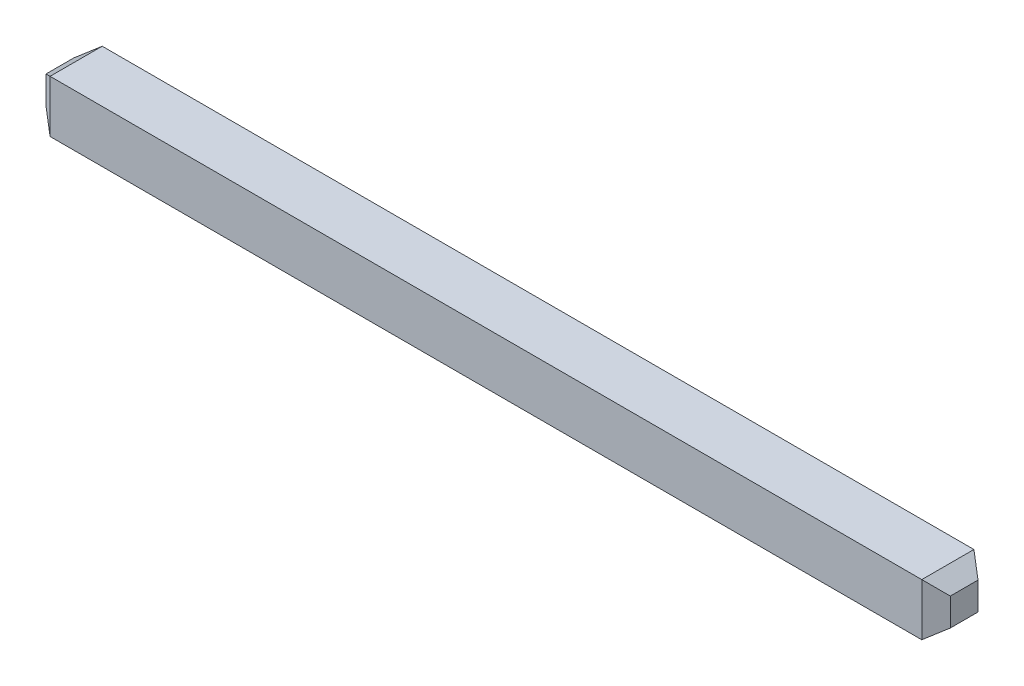
ISO-10303-21;
HEADER;
FILE_DESCRIPTION(('STEP AP214'),'2;1');
FILE_NAME('part.step','',(''),(''),'','','');
FILE_SCHEMA(('AUTOMOTIVE_DESIGN { 1 0 10303 214 1 1 1 1 }'));
ENDSEC;
DATA;
#1=APPLICATION_CONTEXT('core data for automotive mechanical design processes');
#2=APPLICATION_PROTOCOL_DEFINITION('international standard','automotive_design',2000,#1);
#3=PRODUCT_CONTEXT('',#1,'mechanical');
#4=PRODUCT('Part','Part','',(#3));
#5=PRODUCT_RELATED_PRODUCT_CATEGORY('part','',(#4));
#6=PRODUCT_DEFINITION_FORMATION('','',#4);
#7=PRODUCT_DEFINITION_CONTEXT('part definition',#1,'design');
#8=PRODUCT_DEFINITION('design','',#6,#7);
#9=PRODUCT_DEFINITION_SHAPE('','',#8);
#10=(LENGTH_UNIT() NAMED_UNIT(*) SI_UNIT(.MILLI.,.METRE.));
#11=(NAMED_UNIT(*) PLANE_ANGLE_UNIT() SI_UNIT($,.RADIAN.));
#12=(NAMED_UNIT(*) SI_UNIT($,.STERADIAN.) SOLID_ANGLE_UNIT());
#13=UNCERTAINTY_MEASURE_WITH_UNIT(LENGTH_MEASURE(1.E-05),#10,'distance_accuracy_value','');
#14=(GEOMETRIC_REPRESENTATION_CONTEXT(3) GLOBAL_UNCERTAINTY_ASSIGNED_CONTEXT((#13)) GLOBAL_UNIT_ASSIGNED_CONTEXT((#10,
#11,#12)) REPRESENTATION_CONTEXT('',''));
#15=CARTESIAN_POINT('',(0.,0.,0.));
#16=DIRECTION('',(0.,0.,1.));
#17=DIRECTION('',(1.,0.,0.));
#18=AXIS2_PLACEMENT_3D('',#15,#16,#17);
#19=CARTESIAN_POINT('',(-2.4,1.23,-6.595));
#20=DIRECTION('',(0.6,0.,0.8));
#21=DIRECTION('',(0.8,0.,-0.6));
#22=AXIS2_PLACEMENT_3D('',#19,#20,#21);
#23=PLANE('',#22);
#24=DIRECTION('',(0.,1.,0.));
#25=VECTOR('',#24,1.);
#26=CARTESIAN_POINT('',(-2.3,1.23,-6.67));
#27=LINE('',#26,#25);
#28=CARTESIAN_POINT('',(-2.3,1.55,-6.67));
#29=VERTEX_POINT('',#28);
#30=CARTESIAN_POINT('',(-2.30000000000001,0.909999999999898,-6.67));
#31=VERTEX_POINT('',#30);
#32=EDGE_CURVE('E101',#29,#31,#27,.F.);
#33=ORIENTED_EDGE('',*,*,#32,.T.);
#34=DIRECTION('',(-0.685994340569492,0.514495755428341,0.514495755427436));
#35=VECTOR('',#34,1.);
#36=CARTESIAN_POINT('',(-2.30000000000009,0.909999999999786,-6.67));
#37=LINE('',#36,#35);
#38=CARTESIAN_POINT('',(-2.49999999999999,1.06000000000001,-6.52));
#39=VERTEX_POINT('',#38);
#40=EDGE_CURVE('E85',#31,#39,#37,.T.);
#41=ORIENTED_EDGE('',*,*,#40,.T.);
#42=DIRECTION('',(0.,1.,0.));
#43=VECTOR('',#42,1.);
#44=CARTESIAN_POINT('',(-2.5,1.23,-6.52));
#45=LINE('',#44,#43);
#46=CARTESIAN_POINT('',(-2.5,1.4,-6.52));
#47=VERTEX_POINT('',#46);
#48=EDGE_CURVE('E79',#39,#47,#45,.T.);
#49=ORIENTED_EDGE('',*,*,#48,.T.);
#50=DIRECTION('',(-0.685994340570035,-0.514495755427527,0.514495755427526));
#51=VECTOR('',#50,1.);
#52=CARTESIAN_POINT('',(-2.3,1.55,-6.67));
#53=LINE('',#52,#51);
#54=EDGE_CURVE('E20',#29,#47,#53,.T.);
#55=ORIENTED_EDGE('',*,*,#54,.F.);
#56=EDGE_LOOP('',(#33,#41,#49,#55));
#57=FACE_BOUND('',#56,.T.);
#58=ADVANCED_FACE('F17',(#57),#23,.F.);
#59=CARTESIAN_POINT('',(8.5,1.23,-6.595));
#60=DIRECTION('',(-0.6,0.,0.8));
#61=DIRECTION('',(0.8,0.,0.6));
#62=AXIS2_PLACEMENT_3D('',#59,#60,#61);
#63=PLANE('',#62);
#64=DIRECTION('',(0.,1.,0.));
#65=VECTOR('',#64,1.);
#66=CARTESIAN_POINT('',(8.6,1.23,-6.52));
#67=LINE('',#66,#65);
#68=CARTESIAN_POINT('',(8.59999999999998,1.06000000000003,-6.52));
#69=VERTEX_POINT('',#68);
#70=CARTESIAN_POINT('',(8.6,1.4,-6.52));
#71=VERTEX_POINT('',#70);
#72=EDGE_CURVE('E113',#69,#71,#67,.T.);
#73=ORIENTED_EDGE('',*,*,#72,.F.);
#74=DIRECTION('',(-0.685994340569493,-0.514495755428341,-0.514495755427435));
#75=VECTOR('',#74,1.);
#76=CARTESIAN_POINT('',(8.59999999999996,1.06000000000005,-6.52));
#77=LINE('',#76,#75);
#78=CARTESIAN_POINT('',(8.40000000000002,0.909999999999884,-6.67));
#79=VERTEX_POINT('',#78);
#80=EDGE_CURVE('E108',#69,#79,#77,.T.);
#81=ORIENTED_EDGE('',*,*,#80,.T.);
#82=DIRECTION('',(0.,1.,0.));
#83=VECTOR('',#82,1.);
#84=CARTESIAN_POINT('',(8.4,1.23,-6.67));
#85=LINE('',#84,#83);
#86=CARTESIAN_POINT('',(8.4,1.55,-6.67));
#87=VERTEX_POINT('',#86);
#88=EDGE_CURVE('E99',#79,#87,#85,.T.);
#89=ORIENTED_EDGE('',*,*,#88,.T.);
#90=DIRECTION('',(-0.685994340570034,0.514495755427526,-0.514495755427529));
#91=VECTOR('',#90,1.);
#92=CARTESIAN_POINT('',(8.6,1.4,-6.52));
#93=LINE('',#92,#91);
#94=EDGE_CURVE('E116',#71,#87,#93,.T.);
#95=ORIENTED_EDGE('',*,*,#94,.F.);
#96=EDGE_LOOP('',(#73,#81,#89,#95));
#97=FACE_BOUND('',#96,.T.);
#98=ADVANCED_FACE('F214',(#97),#63,.F.);
#99=CARTESIAN_POINT('',(-2.4,1.475,-6.35));
#100=DIRECTION('',(-0.6,0.8,0.));
#101=DIRECTION('',(-0.8,-0.6,0.));
#102=AXIS2_PLACEMENT_3D('',#99,#100,#101);
#103=PLANE('',#102);
#104=DIRECTION('',(-0.685994340570036,-0.514495755427528,-0.514495755427524));
#105=VECTOR('',#104,1.);
#106=CARTESIAN_POINT('',(-2.3,1.55,-6.03));
#107=LINE('',#106,#105);
#108=CARTESIAN_POINT('',(-2.3,1.55,-6.03));
#109=VERTEX_POINT('',#108);
#110=CARTESIAN_POINT('',(-2.5,1.4,-6.18));
#111=VERTEX_POINT('',#110);
#112=EDGE_CURVE('E128',#109,#111,#107,.T.);
#113=ORIENTED_EDGE('',*,*,#112,.F.);
#114=DIRECTION('',(0.,0.,1.));
#115=VECTOR('',#114,1.);
#116=CARTESIAN_POINT('',(-2.3,1.55,-6.35));
#117=LINE('',#116,#115);
#118=EDGE_CURVE('E93',#29,#109,#117,.T.);
#119=ORIENTED_EDGE('',*,*,#118,.F.);
#120=ORIENTED_EDGE('',*,*,#54,.T.);
#121=DIRECTION('',(0.,0.,-1.));
#122=VECTOR('',#121,1.);
#123=CARTESIAN_POINT('',(-2.5,1.4,-6.35));
#124=LINE('',#123,#122);
#125=EDGE_CURVE('E87',#47,#111,#124,.F.);
#126=ORIENTED_EDGE('',*,*,#125,.T.);
#127=EDGE_LOOP('',(#113,#119,#120,#126));
#128=FACE_BOUND('',#127,.T.);
#129=ADVANCED_FACE('F90',(#128),#103,.T.);
#130=CARTESIAN_POINT('',(-2.5,1.23,-6.35));
#131=DIRECTION('',(1.,0.,0.));
#132=DIRECTION('',(0.,0.,-1.));
#133=AXIS2_PLACEMENT_3D('',#130,#131,#132);
#134=PLANE('',#133);
#135=DIRECTION('',(0.,1.,0.));
#136=VECTOR('',#135,1.);
#137=CARTESIAN_POINT('',(-2.5,1.23,-6.18));
#138=LINE('',#137,#136);
#139=CARTESIAN_POINT('',(-2.49999999999999,1.06000000000001,-6.18));
#140=VERTEX_POINT('',#139);
#141=EDGE_CURVE('E97',#111,#140,#138,.F.);
#142=ORIENTED_EDGE('',*,*,#141,.F.);
#143=ORIENTED_EDGE('',*,*,#125,.F.);
#144=ORIENTED_EDGE('',*,*,#48,.F.);
#145=DIRECTION('',(0.,0.,1.));
#146=VECTOR('',#145,1.);
#147=CARTESIAN_POINT('',(-2.49999999999996,1.06000000000005,-6.35));
#148=LINE('',#147,#146);
#149=EDGE_CURVE('E105',#39,#140,#148,.T.);
#150=ORIENTED_EDGE('',*,*,#149,.T.);
#151=EDGE_LOOP('',(#142,#143,#144,#150));
#152=FACE_BOUND('',#151,.T.);
#153=ADVANCED_FACE('F95',(#152),#134,.F.);
#154=CARTESIAN_POINT('',(3.05,1.23,-6.67));
#155=DIRECTION('',(0.,0.,1.));
#156=DIRECTION('',(1.,0.,0.));
#157=AXIS2_PLACEMENT_3D('',#154,#155,#156);
#158=PLANE('',#157);
#159=ORIENTED_EDGE('',*,*,#32,.F.);
#160=DIRECTION('',(1.,0.,0.));
#161=VECTOR('',#160,1.);
#162=CARTESIAN_POINT('',(3.05,1.55,-6.67));
#163=LINE('',#162,#161);
#164=EDGE_CURVE('E122',#87,#29,#163,.F.);
#165=ORIENTED_EDGE('',*,*,#164,.F.);
#166=ORIENTED_EDGE('',*,*,#88,.F.);
#167=DIRECTION('',(1.,0.,0.));
#168=VECTOR('',#167,1.);
#169=CARTESIAN_POINT('',(3.05,0.91,-6.67));
#170=LINE('',#169,#168);
#171=EDGE_CURVE('E136',#79,#31,#170,.F.);
#172=ORIENTED_EDGE('',*,*,#171,.T.);
#173=EDGE_LOOP('',(#159,#165,#166,#172));
#174=FACE_BOUND('',#173,.T.);
#175=ADVANCED_FACE('F182',(#174),#158,.F.);
#176=CARTESIAN_POINT('',(-2.4,0.9849999999999,-6.35));
#177=DIRECTION('',(0.600000000000912,0.799999999999316,0.));
#178=DIRECTION('',(-0.799999999999316,0.600000000000912,0.));
#179=AXIS2_PLACEMENT_3D('',#176,#177,#178);
#180=PLANE('',#179);
#181=DIRECTION('',(0.,0.,1.));
#182=VECTOR('',#181,1.);
#183=CARTESIAN_POINT('',(-2.3,0.91,-6.35));
#184=LINE('',#183,#182);
#185=CARTESIAN_POINT('',(-2.30000000000004,0.909999999999856,-6.03));
#186=VERTEX_POINT('',#185);
#187=EDGE_CURVE('E139',#31,#186,#184,.T.);
#188=ORIENTED_EDGE('',*,*,#187,.T.);
#189=DIRECTION('',(0.685994340569915,-0.51449575542778,0.514495755427434));
#190=VECTOR('',#189,1.);
#191=CARTESIAN_POINT('',(-2.5,1.06,-6.18));
#192=LINE('',#191,#190);
#193=EDGE_CURVE('E131',#140,#186,#192,.T.);
#194=ORIENTED_EDGE('',*,*,#193,.F.);
#195=ORIENTED_EDGE('',*,*,#149,.F.);
#196=ORIENTED_EDGE('',*,*,#40,.F.);
#197=EDGE_LOOP('',(#188,#194,#195,#196));
#198=FACE_BOUND('',#197,.T.);
#199=ADVANCED_FACE('F179',(#198),#180,.F.);
#200=CARTESIAN_POINT('',(8.5,0.9849999999999,-6.35));
#201=DIRECTION('',(-0.600000000000912,0.799999999999316,0.));
#202=DIRECTION('',(-0.799999999999316,-0.600000000000912,0.));
#203=AXIS2_PLACEMENT_3D('',#200,#201,#202);
#204=PLANE('',#203);
#205=DIRECTION('',(0.,0.,-1.));
#206=VECTOR('',#205,1.);
#207=CARTESIAN_POINT('',(8.6,1.06,-6.35));
#208=LINE('',#207,#206);
#209=CARTESIAN_POINT('',(8.59999999999998,1.06000000000003,-6.18));
#210=VERTEX_POINT('',#209);
#211=EDGE_CURVE('E110',#210,#69,#208,.T.);
#212=ORIENTED_EDGE('',*,*,#211,.F.);
#213=DIRECTION('',(0.685994340569913,0.514495755427781,-0.514495755427435));
#214=VECTOR('',#213,1.);
#215=CARTESIAN_POINT('',(8.4,0.9099999999999,-6.03));
#216=LINE('',#215,#214);
#217=CARTESIAN_POINT('',(8.40000000000004,0.909999999999868,-6.03));
#218=VERTEX_POINT('',#217);
#219=EDGE_CURVE('E35',#218,#210,#216,.T.);
#220=ORIENTED_EDGE('',*,*,#219,.F.);
#221=DIRECTION('',(0.,0.,1.));
#222=VECTOR('',#221,1.);
#223=CARTESIAN_POINT('',(8.4,0.91,-6.35));
#224=LINE('',#223,#222);
#225=EDGE_CURVE('E134',#218,#79,#224,.F.);
#226=ORIENTED_EDGE('',*,*,#225,.T.);
#227=ORIENTED_EDGE('',*,*,#80,.F.);
#228=EDGE_LOOP('',(#212,#220,#226,#227));
#229=FACE_BOUND('',#228,.T.);
#230=ADVANCED_FACE('F181',(#229),#204,.F.);
#231=CARTESIAN_POINT('',(8.6,1.23,-6.35));
#232=DIRECTION('',(1.,0.,0.));
#233=DIRECTION('',(0.,0.,-1.));
#234=AXIS2_PLACEMENT_3D('',#231,#232,#233);
#235=PLANE('',#234);
#236=ORIENTED_EDGE('',*,*,#72,.T.);
#237=DIRECTION('',(0.,0.,1.));
#238=VECTOR('',#237,1.);
#239=CARTESIAN_POINT('',(8.6,1.4,-6.35));
#240=LINE('',#239,#238);
#241=CARTESIAN_POINT('',(8.6,1.4,-6.18));
#242=VERTEX_POINT('',#241);
#243=EDGE_CURVE('E119',#242,#71,#240,.F.);
#244=ORIENTED_EDGE('',*,*,#243,.F.);
#245=DIRECTION('',(0.,1.,0.));
#246=VECTOR('',#245,1.);
#247=CARTESIAN_POINT('',(8.6,1.23,-6.18));
#248=LINE('',#247,#246);
#249=EDGE_CURVE('E142',#210,#242,#248,.T.);
#250=ORIENTED_EDGE('',*,*,#249,.F.);
#251=ORIENTED_EDGE('',*,*,#211,.T.);
#252=EDGE_LOOP('',(#236,#244,#250,#251));
#253=FACE_BOUND('',#252,.T.);
#254=ADVANCED_FACE('F189',(#253),#235,.T.);
#255=CARTESIAN_POINT('',(8.5,1.475,-6.35));
#256=DIRECTION('',(0.6,0.8,0.));
#257=DIRECTION('',(-0.8,0.6,0.));
#258=AXIS2_PLACEMENT_3D('',#255,#256,#257);
#259=PLANE('',#258);
#260=DIRECTION('',(-0.685994340570034,0.514495755427529,0.514495755427526));
#261=VECTOR('',#260,1.);
#262=CARTESIAN_POINT('',(8.6,1.4,-6.18));
#263=LINE('',#262,#261);
#264=CARTESIAN_POINT('',(8.4,1.55,-6.03));
#265=VERTEX_POINT('',#264);
#266=EDGE_CURVE('E145',#242,#265,#263,.T.);
#267=ORIENTED_EDGE('',*,*,#266,.F.);
#268=ORIENTED_EDGE('',*,*,#243,.T.);
#269=ORIENTED_EDGE('',*,*,#94,.T.);
#270=DIRECTION('',(0.,0.,1.));
#271=VECTOR('',#270,1.);
#272=CARTESIAN_POINT('',(8.4,1.55,-6.35));
#273=LINE('',#272,#271);
#274=EDGE_CURVE('E125',#265,#87,#273,.F.);
#275=ORIENTED_EDGE('',*,*,#274,.F.);
#276=EDGE_LOOP('',(#267,#268,#269,#275));
#277=FACE_BOUND('',#276,.T.);
#278=ADVANCED_FACE('F170',(#277),#259,.T.);
#279=CARTESIAN_POINT('',(3.05,1.55,-6.35));
#280=DIRECTION('',(0.,1.,0.));
#281=DIRECTION('',(0.,0.,1.));
#282=AXIS2_PLACEMENT_3D('',#279,#280,#281);
#283=PLANE('',#282);
#284=DIRECTION('',(1.,0.,0.));
#285=VECTOR('',#284,1.);
#286=CARTESIAN_POINT('',(3.05,1.55,-6.03));
#287=LINE('',#286,#285);
#288=EDGE_CURVE('E148',#265,#109,#287,.F.);
#289=ORIENTED_EDGE('',*,*,#288,.F.);
#290=ORIENTED_EDGE('',*,*,#274,.T.);
#291=ORIENTED_EDGE('',*,*,#164,.T.);
#292=ORIENTED_EDGE('',*,*,#118,.T.);
#293=EDGE_LOOP('',(#289,#290,#291,#292));
#294=FACE_BOUND('',#293,.T.);
#295=ADVANCED_FACE('F173',(#294),#283,.T.);
#296=CARTESIAN_POINT('',(-2.4,1.23,-6.105));
#297=DIRECTION('',(-0.6,0.,0.8));
#298=DIRECTION('',(0.8,0.,0.6));
#299=AXIS2_PLACEMENT_3D('',#296,#297,#298);
#300=PLANE('',#299);
#301=ORIENTED_EDGE('',*,*,#193,.T.);
#302=DIRECTION('',(0.,1.,0.));
#303=VECTOR('',#302,1.);
#304=CARTESIAN_POINT('',(-2.3,1.23,-6.03));
#305=LINE('',#304,#303);
#306=EDGE_CURVE('E151',#109,#186,#305,.F.);
#307=ORIENTED_EDGE('',*,*,#306,.F.);
#308=ORIENTED_EDGE('',*,*,#112,.T.);
#309=ORIENTED_EDGE('',*,*,#141,.T.);
#310=EDGE_LOOP('',(#301,#307,#308,#309));
#311=FACE_BOUND('',#310,.T.);
#312=ADVANCED_FACE('F176',(#311),#300,.T.);
#313=CARTESIAN_POINT('',(3.05,0.91,-6.35));
#314=DIRECTION('',(0.,1.,0.));
#315=DIRECTION('',(0.,0.,1.));
#316=AXIS2_PLACEMENT_3D('',#313,#314,#315);
#317=PLANE('',#316);
#318=ORIENTED_EDGE('',*,*,#187,.F.);
#319=ORIENTED_EDGE('',*,*,#171,.F.);
#320=ORIENTED_EDGE('',*,*,#225,.F.);
#321=DIRECTION('',(1.,0.,0.));
#322=VECTOR('',#321,1.);
#323=CARTESIAN_POINT('',(3.05,0.9099999999999,-6.03));
#324=LINE('',#323,#322);
#325=EDGE_CURVE('E26',#186,#218,#324,.T.);
#326=ORIENTED_EDGE('',*,*,#325,.F.);
#327=EDGE_LOOP('',(#318,#319,#320,#326));
#328=FACE_BOUND('',#327,.T.);
#329=ADVANCED_FACE('F162',(#328),#317,.F.);
#330=CARTESIAN_POINT('',(8.5,1.23,-6.105));
#331=DIRECTION('',(0.6,0.,0.8));
#332=DIRECTION('',(0.8,0.,-0.6));
#333=AXIS2_PLACEMENT_3D('',#330,#331,#332);
#334=PLANE('',#333);
#335=ORIENTED_EDGE('',*,*,#266,.T.);
#336=DIRECTION('',(0.,1.,0.));
#337=VECTOR('',#336,1.);
#338=CARTESIAN_POINT('',(8.4,1.23,-6.03));
#339=LINE('',#338,#337);
#340=EDGE_CURVE('E11',#218,#265,#339,.T.);
#341=ORIENTED_EDGE('',*,*,#340,.F.);
#342=ORIENTED_EDGE('',*,*,#219,.T.);
#343=ORIENTED_EDGE('',*,*,#249,.T.);
#344=EDGE_LOOP('',(#335,#341,#342,#343));
#345=FACE_BOUND('',#344,.T.);
#346=ADVANCED_FACE('F166',(#345),#334,.T.);
#347=CARTESIAN_POINT('',(3.05,1.23,-6.03));
#348=DIRECTION('',(0.,0.,1.));
#349=DIRECTION('',(1.,0.,0.));
#350=AXIS2_PLACEMENT_3D('',#347,#348,#349);
#351=PLANE('',#350);
#352=ORIENTED_EDGE('',*,*,#325,.T.);
#353=ORIENTED_EDGE('',*,*,#340,.T.);
#354=ORIENTED_EDGE('',*,*,#288,.T.);
#355=ORIENTED_EDGE('',*,*,#306,.T.);
#356=EDGE_LOOP('',(#352,#353,#354,#355));
#357=FACE_BOUND('',#356,.T.);
#358=ADVANCED_FACE('F157',(#357),#351,.T.);
#359=CLOSED_SHELL('',(#58,#98,#129,#153,#175,#199,#230,#254,#278,#295,#312,#329,#346,#358));
#360=MANIFOLD_SOLID_BREP('B1',#359);
#361=ADVANCED_BREP_SHAPE_REPRESENTATION('',(#18,#360),#14);
#362=SHAPE_DEFINITION_REPRESENTATION(#9,#361);
ENDSEC;
END-ISO-10303-21;
